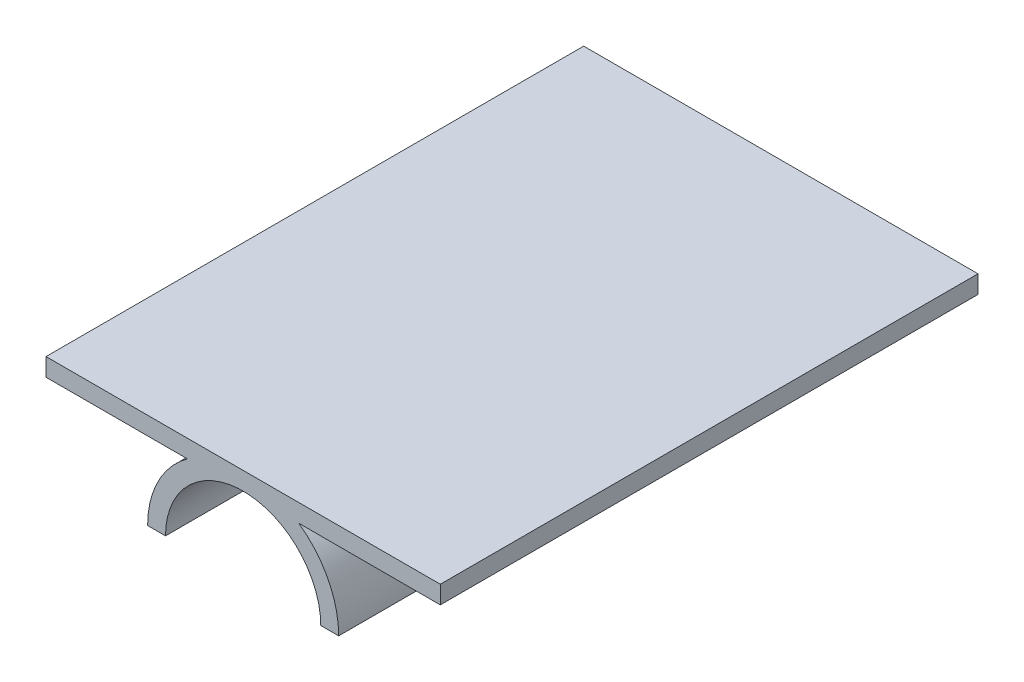
ISO-10303-21;
HEADER;
FILE_DESCRIPTION(('STEP AP214'),'2;1');
FILE_NAME('part.step','',(''),(''),'','','');
FILE_SCHEMA(('AUTOMOTIVE_DESIGN { 1 0 10303 214 1 1 1 1 }'));
ENDSEC;
DATA;
#1=APPLICATION_CONTEXT('core data for automotive mechanical design processes');
#2=APPLICATION_PROTOCOL_DEFINITION('international standard','automotive_design',2000,#1);
#3=PRODUCT_CONTEXT('',#1,'mechanical');
#4=PRODUCT('Part','Part','',(#3));
#5=PRODUCT_RELATED_PRODUCT_CATEGORY('part','',(#4));
#6=PRODUCT_DEFINITION_FORMATION('','',#4);
#7=PRODUCT_DEFINITION_CONTEXT('part definition',#1,'design');
#8=PRODUCT_DEFINITION('design','',#6,#7);
#9=PRODUCT_DEFINITION_SHAPE('','',#8);
#10=(LENGTH_UNIT() NAMED_UNIT(*) SI_UNIT(.MILLI.,.METRE.));
#11=(NAMED_UNIT(*) PLANE_ANGLE_UNIT() SI_UNIT($,.RADIAN.));
#12=(NAMED_UNIT(*) SI_UNIT($,.STERADIAN.) SOLID_ANGLE_UNIT());
#13=UNCERTAINTY_MEASURE_WITH_UNIT(LENGTH_MEASURE(1.E-05),#10,'distance_accuracy_value','');
#14=(GEOMETRIC_REPRESENTATION_CONTEXT(3) GLOBAL_UNCERTAINTY_ASSIGNED_CONTEXT((#13)) GLOBAL_UNIT_ASSIGNED_CONTEXT((#10,
#11,#12)) REPRESENTATION_CONTEXT('',''));
#15=CARTESIAN_POINT('',(0.,0.,0.));
#16=DIRECTION('',(0.,0.,1.));
#17=DIRECTION('',(1.,0.,0.));
#18=AXIS2_PLACEMENT_3D('',#15,#16,#17);
#19=CARTESIAN_POINT('',(0.,0.,76.2));
#20=DIRECTION('',(0.,0.,-1.));
#21=DIRECTION('',(-1.,0.,0.));
#22=AXIS2_PLACEMENT_3D('',#19,#20,#21);
#23=CYLINDRICAL_SURFACE('',#22,13.54);
#24=CARTESIAN_POINT('',(0.,0.,0.));
#25=DIRECTION('',(0.,0.,1.));
#26=DIRECTION('',(-1.,0.,0.));
#27=AXIS2_PLACEMENT_3D('',#24,#25,#26);
#28=CIRCLE('',#27,13.54);
#29=CARTESIAN_POINT('',(-7.89503641536884,11.,0.));
#30=VERTEX_POINT('',#29);
#31=CARTESIAN_POINT('',(-13.54,0.,0.));
#32=VERTEX_POINT('',#31);
#33=EDGE_CURVE('E141',#30,#32,#28,.T.);
#34=ORIENTED_EDGE('',*,*,#33,.T.);
#35=DIRECTION('',(0.,0.,-1.));
#36=VECTOR('',#35,1.);
#37=CARTESIAN_POINT('',(-13.54,0.,76.2));
#38=LINE('',#37,#36);
#39=CARTESIAN_POINT('',(-13.54,0.,76.2));
#40=VERTEX_POINT('',#39);
#41=EDGE_CURVE('E11',#40,#32,#38,.T.);
#42=ORIENTED_EDGE('',*,*,#41,.F.);
#43=CARTESIAN_POINT('',(0.,0.,76.2));
#44=DIRECTION('',(0.,0.,1.));
#45=DIRECTION('',(-1.,0.,0.));
#46=AXIS2_PLACEMENT_3D('',#43,#44,#45);
#47=CIRCLE('',#46,13.54);
#48=CARTESIAN_POINT('',(-7.89503641536884,11.,76.2));
#49=VERTEX_POINT('',#48);
#50=EDGE_CURVE('E159',#49,#40,#47,.T.);
#51=ORIENTED_EDGE('',*,*,#50,.F.);
#52=DIRECTION('',(0.,0.,-1.));
#53=VECTOR('',#52,1.);
#54=CARTESIAN_POINT('',(-7.89503641536884,11.,76.2));
#55=LINE('',#54,#53);
#56=EDGE_CURVE('E137',#49,#30,#55,.T.);
#57=ORIENTED_EDGE('',*,*,#56,.T.);
#58=EDGE_LOOP('',(#34,#42,#51,#57));
#59=FACE_BOUND('',#58,.T.);
#60=ADVANCED_FACE('F33',(#59),#23,.T.);
#61=CARTESIAN_POINT('',(-11.,0.,76.2));
#62=DIRECTION('',(0.,1.,0.));
#63=DIRECTION('',(-1.,0.,0.));
#64=AXIS2_PLACEMENT_3D('',#61,#62,#63);
#65=PLANE('',#64);
#66=DIRECTION('',(1.,0.,0.));
#67=VECTOR('',#66,1.);
#68=CARTESIAN_POINT('',(-11.,0.,0.));
#69=LINE('',#68,#67);
#70=CARTESIAN_POINT('',(-11.,0.,0.));
#71=VERTEX_POINT('',#70);
#72=EDGE_CURVE('E144',#32,#71,#69,.T.);
#73=ORIENTED_EDGE('',*,*,#72,.T.);
#74=DIRECTION('',(0.,0.,-1.));
#75=VECTOR('',#74,1.);
#76=CARTESIAN_POINT('',(-11.,0.,76.2));
#77=LINE('',#76,#75);
#78=CARTESIAN_POINT('',(-11.,0.,76.2));
#79=VERTEX_POINT('',#78);
#80=EDGE_CURVE('E41',#79,#71,#77,.T.);
#81=ORIENTED_EDGE('',*,*,#80,.F.);
#82=DIRECTION('',(1.,0.,0.));
#83=VECTOR('',#82,1.);
#84=CARTESIAN_POINT('',(-11.,0.,76.2));
#85=LINE('',#84,#83);
#86=EDGE_CURVE('E98',#40,#79,#85,.T.);
#87=ORIENTED_EDGE('',*,*,#86,.F.);
#88=ORIENTED_EDGE('',*,*,#41,.T.);
#89=EDGE_LOOP('',(#73,#81,#87,#88));
#90=FACE_BOUND('',#89,.T.);
#91=ADVANCED_FACE('F208',(#90),#65,.F.);
#92=CARTESIAN_POINT('',(0.,0.,76.2));
#93=DIRECTION('',(0.,0.,-1.));
#94=DIRECTION('',(-1.,0.,0.));
#95=AXIS2_PLACEMENT_3D('',#92,#93,#94);
#96=CYLINDRICAL_SURFACE('',#95,11.);
#97=CARTESIAN_POINT('',(0.,0.,0.));
#98=DIRECTION('',(0.,0.,-1.));
#99=DIRECTION('',(-1.,0.,0.));
#100=AXIS2_PLACEMENT_3D('',#97,#98,#99);
#101=CIRCLE('',#100,11.);
#102=CARTESIAN_POINT('',(11.,0.,0.));
#103=VERTEX_POINT('',#102);
#104=EDGE_CURVE('E146',#71,#103,#101,.T.);
#105=ORIENTED_EDGE('',*,*,#104,.T.);
#106=DIRECTION('',(0.,0.,-1.));
#107=VECTOR('',#106,1.);
#108=CARTESIAN_POINT('',(11.,0.,76.2));
#109=LINE('',#108,#107);
#110=CARTESIAN_POINT('',(11.,0.,76.2));
#111=VERTEX_POINT('',#110);
#112=EDGE_CURVE('E172',#111,#103,#109,.T.);
#113=ORIENTED_EDGE('',*,*,#112,.F.);
#114=CARTESIAN_POINT('',(0.,0.,76.2));
#115=DIRECTION('',(0.,0.,-1.));
#116=DIRECTION('',(-1.,0.,0.));
#117=AXIS2_PLACEMENT_3D('',#114,#115,#116);
#118=CIRCLE('',#117,11.);
#119=EDGE_CURVE('E180',#79,#111,#118,.T.);
#120=ORIENTED_EDGE('',*,*,#119,.F.);
#121=ORIENTED_EDGE('',*,*,#80,.T.);
#122=EDGE_LOOP('',(#105,#113,#120,#121));
#123=FACE_BOUND('',#122,.T.);
#124=ADVANCED_FACE('F178',(#123),#96,.F.);
#125=CARTESIAN_POINT('',(11.,0.,76.2));
#126=DIRECTION('',(0.,1.,0.));
#127=DIRECTION('',(-1.,0.,0.));
#128=AXIS2_PLACEMENT_3D('',#125,#126,#127);
#129=PLANE('',#128);
#130=DIRECTION('',(1.,0.,0.));
#131=VECTOR('',#130,1.);
#132=CARTESIAN_POINT('',(11.,0.,0.));
#133=LINE('',#132,#131);
#134=CARTESIAN_POINT('',(13.54,0.,0.));
#135=VERTEX_POINT('',#134);
#136=EDGE_CURVE('E148',#103,#135,#133,.T.);
#137=ORIENTED_EDGE('',*,*,#136,.T.);
#138=DIRECTION('',(0.,0.,-1.));
#139=VECTOR('',#138,1.);
#140=CARTESIAN_POINT('',(13.54,0.,76.2));
#141=LINE('',#140,#139);
#142=CARTESIAN_POINT('',(13.54,0.,76.2));
#143=VERTEX_POINT('',#142);
#144=EDGE_CURVE('E169',#143,#135,#141,.T.);
#145=ORIENTED_EDGE('',*,*,#144,.F.);
#146=DIRECTION('',(1.,0.,0.));
#147=VECTOR('',#146,1.);
#148=CARTESIAN_POINT('',(11.,0.,76.2));
#149=LINE('',#148,#147);
#150=EDGE_CURVE('E198',#111,#143,#149,.T.);
#151=ORIENTED_EDGE('',*,*,#150,.F.);
#152=ORIENTED_EDGE('',*,*,#112,.T.);
#153=EDGE_LOOP('',(#137,#145,#151,#152));
#154=FACE_BOUND('',#153,.T.);
#155=ADVANCED_FACE('F189',(#154),#129,.F.);
#156=CARTESIAN_POINT('',(0.,0.,76.2));
#157=DIRECTION('',(0.,0.,-1.));
#158=DIRECTION('',(-1.,0.,0.));
#159=AXIS2_PLACEMENT_3D('',#156,#157,#158);
#160=CYLINDRICAL_SURFACE('',#159,13.54);
#161=CARTESIAN_POINT('',(0.,0.,0.));
#162=DIRECTION('',(0.,0.,1.));
#163=DIRECTION('',(-1.,0.,0.));
#164=AXIS2_PLACEMENT_3D('',#161,#162,#163);
#165=CIRCLE('',#164,13.54);
#166=CARTESIAN_POINT('',(7.89503641536884,11.,0.));
#167=VERTEX_POINT('',#166);
#168=EDGE_CURVE('E150',#135,#167,#165,.T.);
#169=ORIENTED_EDGE('',*,*,#168,.T.);
#170=DIRECTION('',(0.,0.,-1.));
#171=VECTOR('',#170,1.);
#172=CARTESIAN_POINT('',(7.89503641536884,11.,76.2));
#173=LINE('',#172,#171);
#174=CARTESIAN_POINT('',(7.89503641536884,11.,76.2));
#175=VERTEX_POINT('',#174);
#176=EDGE_CURVE('E166',#175,#167,#173,.T.);
#177=ORIENTED_EDGE('',*,*,#176,.F.);
#178=CARTESIAN_POINT('',(0.,0.,76.2));
#179=DIRECTION('',(0.,0.,1.));
#180=DIRECTION('',(-1.,0.,0.));
#181=AXIS2_PLACEMENT_3D('',#178,#179,#180);
#182=CIRCLE('',#181,13.54);
#183=EDGE_CURVE('E195',#143,#175,#182,.T.);
#184=ORIENTED_EDGE('',*,*,#183,.F.);
#185=ORIENTED_EDGE('',*,*,#144,.T.);
#186=EDGE_LOOP('',(#169,#177,#184,#185));
#187=FACE_BOUND('',#186,.T.);
#188=ADVANCED_FACE('F193',(#187),#160,.T.);
#189=CARTESIAN_POINT('',(27.94,11.,76.2));
#190=DIRECTION('',(0.,1.,0.));
#191=DIRECTION('',(-1.,0.,0.));
#192=AXIS2_PLACEMENT_3D('',#189,#190,#191);
#193=PLANE('',#192);
#194=DIRECTION('',(1.,0.,0.));
#195=VECTOR('',#194,1.);
#196=CARTESIAN_POINT('',(27.94,11.,0.));
#197=LINE('',#196,#195);
#198=CARTESIAN_POINT('',(27.94,11.,0.));
#199=VERTEX_POINT('',#198);
#200=EDGE_CURVE('E152',#167,#199,#197,.T.);
#201=ORIENTED_EDGE('',*,*,#200,.T.);
#202=DIRECTION('',(0.,0.,-1.));
#203=VECTOR('',#202,1.);
#204=CARTESIAN_POINT('',(27.94,11.,76.2));
#205=LINE('',#204,#203);
#206=CARTESIAN_POINT('',(27.94,11.,76.2));
#207=VERTEX_POINT('',#206);
#208=EDGE_CURVE('E163',#207,#199,#205,.T.);
#209=ORIENTED_EDGE('',*,*,#208,.F.);
#210=DIRECTION('',(1.,0.,0.));
#211=VECTOR('',#210,1.);
#212=CARTESIAN_POINT('',(27.94,11.,76.2));
#213=LINE('',#212,#211);
#214=EDGE_CURVE('E197',#175,#207,#213,.T.);
#215=ORIENTED_EDGE('',*,*,#214,.F.);
#216=ORIENTED_EDGE('',*,*,#176,.T.);
#217=EDGE_LOOP('',(#201,#209,#215,#216));
#218=FACE_BOUND('',#217,.T.);
#219=ADVANCED_FACE('F220',(#218),#193,.F.);
#220=CARTESIAN_POINT('',(27.94,11.,76.2));
#221=DIRECTION('',(-1.,0.,0.));
#222=DIRECTION('',(0.,0.,1.));
#223=AXIS2_PLACEMENT_3D('',#220,#221,#222);
#224=PLANE('',#223);
#225=DIRECTION('',(0.,1.,0.));
#226=VECTOR('',#225,1.);
#227=CARTESIAN_POINT('',(27.94,11.,0.));
#228=LINE('',#227,#226);
#229=CARTESIAN_POINT('',(27.94,13.54,0.));
#230=VERTEX_POINT('',#229);
#231=EDGE_CURVE('E154',#199,#230,#228,.T.);
#232=ORIENTED_EDGE('',*,*,#231,.T.);
#233=DIRECTION('',(0.,0.,-1.));
#234=VECTOR('',#233,1.);
#235=CARTESIAN_POINT('',(27.94,13.54,76.2));
#236=LINE('',#235,#234);
#237=CARTESIAN_POINT('',(27.94,13.54,76.2));
#238=VERTEX_POINT('',#237);
#239=EDGE_CURVE('E132',#238,#230,#236,.T.);
#240=ORIENTED_EDGE('',*,*,#239,.F.);
#241=DIRECTION('',(0.,1.,0.));
#242=VECTOR('',#241,1.);
#243=CARTESIAN_POINT('',(27.94,11.,76.2));
#244=LINE('',#243,#242);
#245=EDGE_CURVE('E123',#207,#238,#244,.T.);
#246=ORIENTED_EDGE('',*,*,#245,.F.);
#247=ORIENTED_EDGE('',*,*,#208,.T.);
#248=EDGE_LOOP('',(#232,#240,#246,#247));
#249=FACE_BOUND('',#248,.T.);
#250=ADVANCED_FACE('F223',(#249),#224,.F.);
#251=CARTESIAN_POINT('',(27.94,13.54,76.2));
#252=DIRECTION('',(0.,-1.,0.));
#253=DIRECTION('',(1.,0.,0.));
#254=AXIS2_PLACEMENT_3D('',#251,#252,#253);
#255=PLANE('',#254);
#256=DIRECTION('',(-1.,0.,0.));
#257=VECTOR('',#256,1.);
#258=CARTESIAN_POINT('',(27.94,13.54,0.));
#259=LINE('',#258,#257);
#260=CARTESIAN_POINT('',(-27.94,13.54,0.));
#261=VERTEX_POINT('',#260);
#262=EDGE_CURVE('E131',#230,#261,#259,.T.);
#263=ORIENTED_EDGE('',*,*,#262,.T.);
#264=DIRECTION('',(0.,0.,-1.));
#265=VECTOR('',#264,1.);
#266=CARTESIAN_POINT('',(-27.94,13.54,76.2));
#267=LINE('',#266,#265);
#268=CARTESIAN_POINT('',(-27.94,13.54,76.2));
#269=VERTEX_POINT('',#268);
#270=EDGE_CURVE('E128',#269,#261,#267,.T.);
#271=ORIENTED_EDGE('',*,*,#270,.F.);
#272=DIRECTION('',(-1.,0.,0.));
#273=VECTOR('',#272,1.);
#274=CARTESIAN_POINT('',(27.94,13.54,76.2));
#275=LINE('',#274,#273);
#276=EDGE_CURVE('E117',#238,#269,#275,.T.);
#277=ORIENTED_EDGE('',*,*,#276,.F.);
#278=ORIENTED_EDGE('',*,*,#239,.T.);
#279=EDGE_LOOP('',(#263,#271,#277,#278));
#280=FACE_BOUND('',#279,.T.);
#281=ADVANCED_FACE('F129',(#280),#255,.F.);
#282=CARTESIAN_POINT('',(-27.94,11.,76.2));
#283=DIRECTION('',(1.,0.,0.));
#284=DIRECTION('',(0.,0.,-1.));
#285=AXIS2_PLACEMENT_3D('',#282,#283,#284);
#286=PLANE('',#285);
#287=DIRECTION('',(0.,-1.,0.));
#288=VECTOR('',#287,1.);
#289=CARTESIAN_POINT('',(-27.94,11.,0.));
#290=LINE('',#289,#288);
#291=CARTESIAN_POINT('',(-27.94,11.,0.));
#292=VERTEX_POINT('',#291);
#293=EDGE_CURVE('E84',#261,#292,#290,.T.);
#294=ORIENTED_EDGE('',*,*,#293,.T.);
#295=DIRECTION('',(0.,0.,-1.));
#296=VECTOR('',#295,1.);
#297=CARTESIAN_POINT('',(-27.94,11.,76.2));
#298=LINE('',#297,#296);
#299=CARTESIAN_POINT('',(-27.94,11.,76.2));
#300=VERTEX_POINT('',#299);
#301=EDGE_CURVE('E133',#300,#292,#298,.T.);
#302=ORIENTED_EDGE('',*,*,#301,.F.);
#303=DIRECTION('',(0.,-1.,0.));
#304=VECTOR('',#303,1.);
#305=CARTESIAN_POINT('',(-27.94,11.,76.2));
#306=LINE('',#305,#304);
#307=EDGE_CURVE('E121',#269,#300,#306,.T.);
#308=ORIENTED_EDGE('',*,*,#307,.F.);
#309=ORIENTED_EDGE('',*,*,#270,.T.);
#310=EDGE_LOOP('',(#294,#302,#308,#309));
#311=FACE_BOUND('',#310,.T.);
#312=ADVANCED_FACE('F135',(#311),#286,.F.);
#313=CARTESIAN_POINT('',(-7.89503641536884,11.,76.2));
#314=DIRECTION('',(0.,1.,0.));
#315=DIRECTION('',(-1.,0.,0.));
#316=AXIS2_PLACEMENT_3D('',#313,#314,#315);
#317=PLANE('',#316);
#318=DIRECTION('',(1.,0.,0.));
#319=VECTOR('',#318,1.);
#320=CARTESIAN_POINT('',(-7.89503641536884,11.,0.));
#321=LINE('',#320,#319);
#322=EDGE_CURVE('E90',#292,#30,#321,.T.);
#323=ORIENTED_EDGE('',*,*,#322,.T.);
#324=ORIENTED_EDGE('',*,*,#56,.F.);
#325=DIRECTION('',(1.,0.,0.));
#326=VECTOR('',#325,1.);
#327=CARTESIAN_POINT('',(-7.89503641536884,11.,76.2));
#328=LINE('',#327,#326);
#329=EDGE_CURVE('E49',#300,#49,#328,.T.);
#330=ORIENTED_EDGE('',*,*,#329,.F.);
#331=ORIENTED_EDGE('',*,*,#301,.T.);
#332=EDGE_LOOP('',(#323,#324,#330,#331));
#333=FACE_BOUND('',#332,.T.);
#334=ADVANCED_FACE('F232',(#333),#317,.F.);
#335=CARTESIAN_POINT('',(0.,0.,76.2));
#336=DIRECTION('',(0.,0.,-1.));
#337=DIRECTION('',(-1.,0.,0.));
#338=AXIS2_PLACEMENT_3D('',#335,#336,#337);
#339=PLANE('',#338);
#340=ORIENTED_EDGE('',*,*,#50,.T.);
#341=ORIENTED_EDGE('',*,*,#86,.T.);
#342=ORIENTED_EDGE('',*,*,#119,.T.);
#343=ORIENTED_EDGE('',*,*,#150,.T.);
#344=ORIENTED_EDGE('',*,*,#183,.T.);
#345=ORIENTED_EDGE('',*,*,#214,.T.);
#346=ORIENTED_EDGE('',*,*,#245,.T.);
#347=ORIENTED_EDGE('',*,*,#276,.T.);
#348=ORIENTED_EDGE('',*,*,#307,.T.);
#349=ORIENTED_EDGE('',*,*,#329,.T.);
#350=EDGE_LOOP('',(#340,#341,#342,#343,#344,#345,#346,#347,#348,#349));
#351=FACE_BOUND('',#350,.T.);
#352=ADVANCED_FACE('F119',(#351),#339,.F.);
#353=CARTESIAN_POINT('',(0.,0.,0.));
#354=DIRECTION('',(0.,0.,-1.));
#355=DIRECTION('',(-1.,0.,0.));
#356=AXIS2_PLACEMENT_3D('',#353,#354,#355);
#357=PLANE('',#356);
#358=ORIENTED_EDGE('',*,*,#33,.F.);
#359=ORIENTED_EDGE('',*,*,#322,.F.);
#360=ORIENTED_EDGE('',*,*,#293,.F.);
#361=ORIENTED_EDGE('',*,*,#262,.F.);
#362=ORIENTED_EDGE('',*,*,#231,.F.);
#363=ORIENTED_EDGE('',*,*,#200,.F.);
#364=ORIENTED_EDGE('',*,*,#168,.F.);
#365=ORIENTED_EDGE('',*,*,#136,.F.);
#366=ORIENTED_EDGE('',*,*,#104,.F.);
#367=ORIENTED_EDGE('',*,*,#72,.F.);
#368=EDGE_LOOP('',(#358,#359,#360,#361,#362,#363,#364,#365,#366,#367));
#369=FACE_BOUND('',#368,.T.);
#370=ADVANCED_FACE('F184',(#369),#357,.T.);
#371=CLOSED_SHELL('',(#60,#91,#124,#155,#188,#219,#250,#281,#312,#334,#352,#370));
#372=MANIFOLD_SOLID_BREP('B2',#371);
#373=ADVANCED_BREP_SHAPE_REPRESENTATION('',(#18,#372),#14);
#374=SHAPE_DEFINITION_REPRESENTATION(#9,#373);
ENDSEC;
END-ISO-10303-21;
